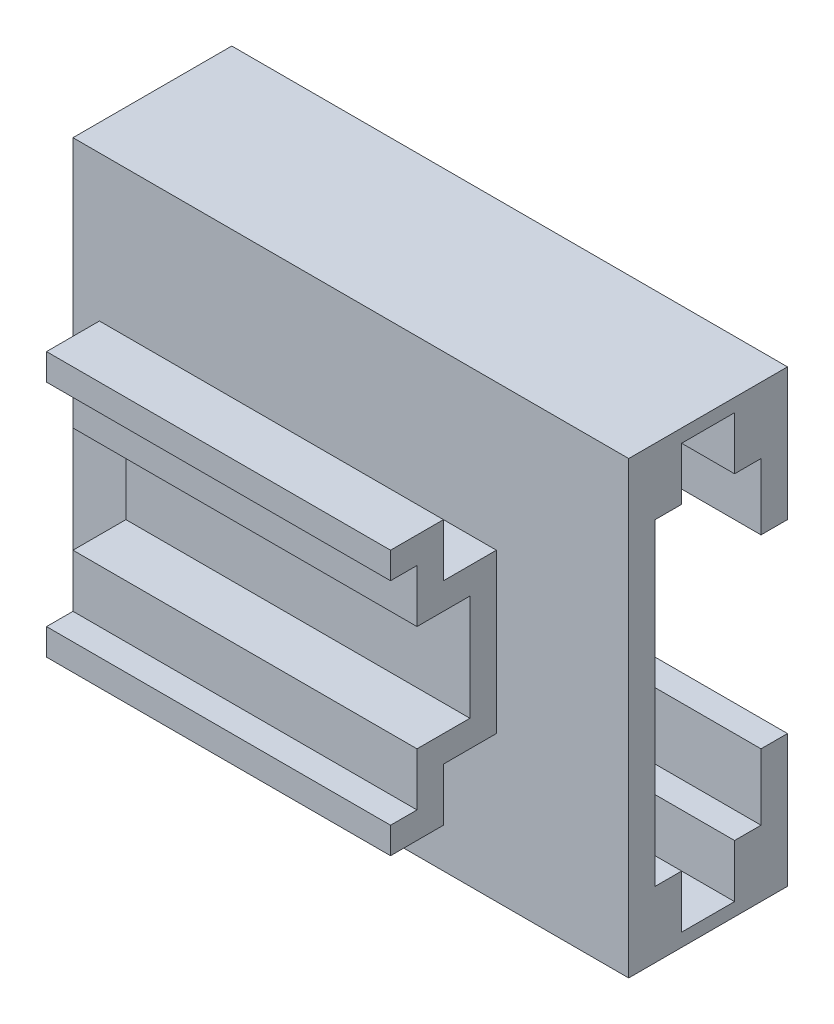
ISO-10303-21;
HEADER;
FILE_DESCRIPTION(('STEP AP214'),'2;1');
FILE_NAME('part.step','',(''),(''),'','','');
FILE_SCHEMA(('AUTOMOTIVE_DESIGN { 1 0 10303 214 1 1 1 1 }'));
ENDSEC;
DATA;
#1=APPLICATION_CONTEXT('core data for automotive mechanical design processes');
#2=APPLICATION_PROTOCOL_DEFINITION('international standard','automotive_design',2000,#1);
#3=PRODUCT_CONTEXT('',#1,'mechanical');
#4=PRODUCT('Part','Part','',(#3));
#5=PRODUCT_RELATED_PRODUCT_CATEGORY('part','',(#4));
#6=PRODUCT_DEFINITION_FORMATION('','',#4);
#7=PRODUCT_DEFINITION_CONTEXT('part definition',#1,'design');
#8=PRODUCT_DEFINITION('design','',#6,#7);
#9=PRODUCT_DEFINITION_SHAPE('','',#8);
#10=(LENGTH_UNIT() NAMED_UNIT(*) SI_UNIT(.MILLI.,.METRE.));
#11=(NAMED_UNIT(*) PLANE_ANGLE_UNIT() SI_UNIT($,.RADIAN.));
#12=(NAMED_UNIT(*) SI_UNIT($,.STERADIAN.) SOLID_ANGLE_UNIT());
#13=UNCERTAINTY_MEASURE_WITH_UNIT(LENGTH_MEASURE(1.E-05),#10,'distance_accuracy_value','');
#14=(GEOMETRIC_REPRESENTATION_CONTEXT(3) GLOBAL_UNCERTAINTY_ASSIGNED_CONTEXT((#13)) GLOBAL_UNIT_ASSIGNED_CONTEXT((#10,
#11,#12)) REPRESENTATION_CONTEXT('',''));
#15=CARTESIAN_POINT('',(0.,0.,0.));
#16=DIRECTION('',(0.,0.,1.));
#17=DIRECTION('',(1.,0.,0.));
#18=AXIS2_PLACEMENT_3D('',#15,#16,#17);
#19=CARTESIAN_POINT('',(0.,0.,1.));
#20=DIRECTION('',(0.,0.,1.));
#21=DIRECTION('',(1.,0.,0.));
#22=AXIS2_PLACEMENT_3D('',#19,#20,#21);
#23=PLANE('',#22);
#24=DIRECTION('',(-1.,0.,0.));
#25=VECTOR('',#24,1.);
#26=CARTESIAN_POINT('',(10.5,8.50000000000001,1.));
#27=LINE('',#26,#25);
#28=CARTESIAN_POINT('',(10.5,8.50000000000001,1.));
#29=VERTEX_POINT('',#28);
#30=CARTESIAN_POINT('',(-10.5,8.5,1.));
#31=VERTEX_POINT('',#30);
#32=EDGE_CURVE('E556',#29,#31,#27,.T.);
#33=ORIENTED_EDGE('',*,*,#32,.T.);
#34=DIRECTION('',(0.,-1.,0.));
#35=VECTOR('',#34,1.);
#36=CARTESIAN_POINT('',(-10.5,8.5,1.));
#37=LINE('',#36,#35);
#38=CARTESIAN_POINT('',(-10.5,-8.5,1.));
#39=VERTEX_POINT('',#38);
#40=EDGE_CURVE('E559',#31,#39,#37,.T.);
#41=ORIENTED_EDGE('',*,*,#40,.T.);
#42=DIRECTION('',(-1.,0.,0.));
#43=VECTOR('',#42,1.);
#44=CARTESIAN_POINT('',(10.5,-8.5,1.));
#45=LINE('',#44,#43);
#46=CARTESIAN_POINT('',(10.5,-8.5,1.));
#47=VERTEX_POINT('',#46);
#48=EDGE_CURVE('E562',#47,#39,#45,.T.);
#49=ORIENTED_EDGE('',*,*,#48,.F.);
#50=DIRECTION('',(0.,-1.,0.));
#51=VECTOR('',#50,1.);
#52=CARTESIAN_POINT('',(10.5,8.50000000000001,1.));
#53=LINE('',#52,#51);
#54=EDGE_CURVE('E565',#29,#47,#53,.T.);
#55=ORIENTED_EDGE('',*,*,#54,.F.);
#56=EDGE_LOOP('',(#33,#41,#49,#55));
#57=FACE_BOUND('',#56,.T.);
#58=DIRECTION('',(-1.,0.,0.));
#59=VECTOR('',#58,1.);
#60=CARTESIAN_POINT('',(5.5,-3.,1.));
#61=LINE('',#60,#59);
#62=CARTESIAN_POINT('',(5.5,-3.,1.));
#63=VERTEX_POINT('',#62);
#64=CARTESIAN_POINT('',(-7.5,-3.,1.));
#65=VERTEX_POINT('',#64);
#66=EDGE_CURVE('E401',#63,#65,#61,.T.);
#67=ORIENTED_EDGE('',*,*,#66,.T.);
#68=DIRECTION('',(0.,1.,0.));
#69=VECTOR('',#68,1.);
#70=CARTESIAN_POINT('',(-7.5,0.,1.));
#71=LINE('',#70,#69);
#72=CARTESIAN_POINT('',(-7.5,3.,1.));
#73=VERTEX_POINT('',#72);
#74=EDGE_CURVE('E389',#65,#73,#71,.T.);
#75=ORIENTED_EDGE('',*,*,#74,.T.);
#76=DIRECTION('',(-1.,0.,0.));
#77=VECTOR('',#76,1.);
#78=CARTESIAN_POINT('',(5.5,3.,1.));
#79=LINE('',#78,#77);
#80=CARTESIAN_POINT('',(5.5,3.,1.));
#81=VERTEX_POINT('',#80);
#82=EDGE_CURVE('E404',#81,#73,#79,.T.);
#83=ORIENTED_EDGE('',*,*,#82,.F.);
#84=DIRECTION('',(0.,1.,0.));
#85=VECTOR('',#84,1.);
#86=CARTESIAN_POINT('',(5.5,0.,1.));
#87=LINE('',#86,#85);
#88=EDGE_CURVE('E353',#63,#81,#87,.T.);
#89=ORIENTED_EDGE('',*,*,#88,.F.);
#90=EDGE_LOOP('',(#67,#75,#83,#89));
#91=FACE_BOUND('',#90,.T.);
#92=ADVANCED_FACE('F66',(#57,#91),#23,.T.);
#93=CARTESIAN_POINT('',(10.5,8.50000000000001,1.));
#94=DIRECTION('',(1.,0.,0.));
#95=DIRECTION('',(0.,1.,0.));
#96=AXIS2_PLACEMENT_3D('',#93,#94,#95);
#97=PLANE('',#96);
#98=DIRECTION('',(0.,0.,1.));
#99=VECTOR('',#98,1.);
#100=CARTESIAN_POINT('',(10.5,-6.,-4.));
#101=LINE('',#100,#99);
#102=CARTESIAN_POINT('',(10.5,-6.,-4.));
#103=VERTEX_POINT('',#102);
#104=CARTESIAN_POINT('',(10.5,-6.,-3.));
#105=VERTEX_POINT('',#104);
#106=EDGE_CURVE('E495',#103,#105,#101,.T.);
#107=ORIENTED_EDGE('',*,*,#106,.T.);
#108=DIRECTION('',(0.,-1.,0.));
#109=VECTOR('',#108,1.);
#110=CARTESIAN_POINT('',(10.5,0.,-3.));
#111=LINE('',#110,#109);
#112=CARTESIAN_POINT('',(10.5,-8.,-3.));
#113=VERTEX_POINT('',#112);
#114=EDGE_CURVE('E437',#105,#113,#111,.T.);
#115=ORIENTED_EDGE('',*,*,#114,.T.);
#116=DIRECTION('',(0.,0.,1.));
#117=VECTOR('',#116,1.);
#118=CARTESIAN_POINT('',(10.5,-8.,-3.));
#119=LINE('',#118,#117);
#120=CARTESIAN_POINT('',(10.5,-8.,-1.));
#121=VERTEX_POINT('',#120);
#122=EDGE_CURVE('E457',#113,#121,#119,.T.);
#123=ORIENTED_EDGE('',*,*,#122,.T.);
#124=DIRECTION('',(0.,-1.,0.));
#125=VECTOR('',#124,1.);
#126=CARTESIAN_POINT('',(10.5,0.,-1.));
#127=LINE('',#126,#125);
#128=CARTESIAN_POINT('',(10.5,-6.,-1.));
#129=VERTEX_POINT('',#128);
#130=EDGE_CURVE('E450',#129,#121,#127,.T.);
#131=ORIENTED_EDGE('',*,*,#130,.F.);
#132=CARTESIAN_POINT('',(10.5,-6.,0.));
#133=VERTEX_POINT('',#132);
#134=EDGE_CURVE('E488',#129,#133,#101,.T.);
#135=ORIENTED_EDGE('',*,*,#134,.T.);
#136=DIRECTION('',(0.,-1.,0.));
#137=VECTOR('',#136,1.);
#138=CARTESIAN_POINT('',(10.5,8.50000000000001,0.));
#139=LINE('',#138,#137);
#140=CARTESIAN_POINT('',(10.5,6.,0.));
#141=VERTEX_POINT('',#140);
#142=EDGE_CURVE('E560',#141,#133,#139,.T.);
#143=ORIENTED_EDGE('',*,*,#142,.F.);
#144=DIRECTION('',(0.,0.,1.));
#145=VECTOR('',#144,1.);
#146=CARTESIAN_POINT('',(10.5,6.,-4.));
#147=LINE('',#146,#145);
#148=CARTESIAN_POINT('',(10.5,6.,-1.));
#149=VERTEX_POINT('',#148);
#150=EDGE_CURVE('E547',#149,#141,#147,.T.);
#151=ORIENTED_EDGE('',*,*,#150,.F.);
#152=DIRECTION('',(0.,-1.,0.));
#153=VECTOR('',#152,1.);
#154=CARTESIAN_POINT('',(10.5,0.,-1.));
#155=LINE('',#154,#153);
#156=CARTESIAN_POINT('',(10.5,8.,-1.));
#157=VERTEX_POINT('',#156);
#158=EDGE_CURVE('E89',#157,#149,#155,.T.);
#159=ORIENTED_EDGE('',*,*,#158,.F.);
#160=DIRECTION('',(0.,0.,1.));
#161=VECTOR('',#160,1.);
#162=CARTESIAN_POINT('',(10.5,8.,-3.));
#163=LINE('',#162,#161);
#164=CARTESIAN_POINT('',(10.5,8.,-3.));
#165=VERTEX_POINT('',#164);
#166=EDGE_CURVE('E447',#165,#157,#163,.T.);
#167=ORIENTED_EDGE('',*,*,#166,.F.);
#168=DIRECTION('',(0.,-1.,0.));
#169=VECTOR('',#168,1.);
#170=CARTESIAN_POINT('',(10.5,0.,-3.));
#171=LINE('',#170,#169);
#172=CARTESIAN_POINT('',(10.5,6.,-3.));
#173=VERTEX_POINT('',#172);
#174=EDGE_CURVE('E469',#165,#173,#171,.T.);
#175=ORIENTED_EDGE('',*,*,#174,.T.);
#176=CARTESIAN_POINT('',(10.5,6.,-4.));
#177=VERTEX_POINT('',#176);
#178=EDGE_CURVE('E553',#177,#173,#147,.T.);
#179=ORIENTED_EDGE('',*,*,#178,.F.);
#180=DIRECTION('',(0.,-1.,0.));
#181=VECTOR('',#180,1.);
#182=CARTESIAN_POINT('',(10.5,8.50000000000001,-4.));
#183=LINE('',#182,#181);
#184=CARTESIAN_POINT('',(10.5,3.5,-4.));
#185=VERTEX_POINT('',#184);
#186=EDGE_CURVE('E529',#177,#185,#183,.T.);
#187=ORIENTED_EDGE('',*,*,#186,.T.);
#188=DIRECTION('',(0.,0.,1.));
#189=VECTOR('',#188,1.);
#190=CARTESIAN_POINT('',(10.5,3.5,-5.));
#191=LINE('',#190,#189);
#192=CARTESIAN_POINT('',(10.5,3.5,-5.));
#193=VERTEX_POINT('',#192);
#194=EDGE_CURVE('E520',#193,#185,#191,.T.);
#195=ORIENTED_EDGE('',*,*,#194,.F.);
#196=DIRECTION('',(0.,-1.,0.));
#197=VECTOR('',#196,1.);
#198=CARTESIAN_POINT('',(10.5,8.50000000000001,-5.));
#199=LINE('',#198,#197);
#200=CARTESIAN_POINT('',(10.5,8.50000000000001,-5.));
#201=VERTEX_POINT('',#200);
#202=EDGE_CURVE('E536',#201,#193,#199,.T.);
#203=ORIENTED_EDGE('',*,*,#202,.F.);
#204=DIRECTION('',(0.,0.,-1.));
#205=VECTOR('',#204,1.);
#206=CARTESIAN_POINT('',(10.5,8.50000000000001,1.));
#207=LINE('',#206,#205);
#208=EDGE_CURVE('E568',#29,#201,#207,.T.);
#209=ORIENTED_EDGE('',*,*,#208,.F.);
#210=ORIENTED_EDGE('',*,*,#54,.T.);
#211=DIRECTION('',(0.,0.,-1.));
#212=VECTOR('',#211,1.);
#213=CARTESIAN_POINT('',(10.5,-8.5,1.));
#214=LINE('',#213,#212);
#215=CARTESIAN_POINT('',(10.5,-8.5,-5.));
#216=VERTEX_POINT('',#215);
#217=EDGE_CURVE('E574',#47,#216,#214,.T.);
#218=ORIENTED_EDGE('',*,*,#217,.T.);
#219=CARTESIAN_POINT('',(10.5,-3.5,-5.));
#220=VERTEX_POINT('',#219);
#221=EDGE_CURVE('E535',#220,#216,#199,.T.);
#222=ORIENTED_EDGE('',*,*,#221,.F.);
#223=DIRECTION('',(0.,0.,1.));
#224=VECTOR('',#223,1.);
#225=CARTESIAN_POINT('',(10.5,-3.5,-5.));
#226=LINE('',#225,#224);
#227=CARTESIAN_POINT('',(10.5,-3.5,-4.));
#228=VERTEX_POINT('',#227);
#229=EDGE_CURVE('E507',#220,#228,#226,.T.);
#230=ORIENTED_EDGE('',*,*,#229,.T.);
#231=EDGE_CURVE('E542',#228,#103,#183,.T.);
#232=ORIENTED_EDGE('',*,*,#231,.T.);
#233=EDGE_LOOP('',(#107,#115,#123,#131,#135,#143,#151,#159,#167,#175,#179,#187,#195,#203,#209,
#210,#218,#222,#230,#232));
#234=FACE_BOUND('',#233,.T.);
#235=ADVANCED_FACE('F597',(#234),#97,.T.);
#236=CARTESIAN_POINT('',(0.,6.,-4.));
#237=DIRECTION('',(0.,-1.,0.));
#238=DIRECTION('',(1.,0.,0.));
#239=AXIS2_PLACEMENT_3D('',#236,#237,#238);
#240=PLANE('',#239);
#241=ORIENTED_EDGE('',*,*,#178,.T.);
#242=DIRECTION('',(1.,0.,0.));
#243=VECTOR('',#242,1.);
#244=CARTESIAN_POINT('',(0.,6.,-3.));
#245=LINE('',#244,#243);
#246=CARTESIAN_POINT('',(-9.,6.,-3.));
#247=VERTEX_POINT('',#246);
#248=EDGE_CURVE('E467',#247,#173,#245,.T.);
#249=ORIENTED_EDGE('',*,*,#248,.F.);
#250=DIRECTION('',(0.,0.,1.));
#251=VECTOR('',#250,1.);
#252=CARTESIAN_POINT('',(-9.,6.,-3.));
#253=LINE('',#252,#251);
#254=CARTESIAN_POINT('',(-9.,6.,-1.));
#255=VERTEX_POINT('',#254);
#256=EDGE_CURVE('E481',#247,#255,#253,.T.);
#257=ORIENTED_EDGE('',*,*,#256,.T.);
#258=DIRECTION('',(1.,0.,0.));
#259=VECTOR('',#258,1.);
#260=CARTESIAN_POINT('',(0.,6.,-1.));
#261=LINE('',#260,#259);
#262=EDGE_CURVE('E477',#255,#149,#261,.T.);
#263=ORIENTED_EDGE('',*,*,#262,.T.);
#264=ORIENTED_EDGE('',*,*,#150,.T.);
#265=DIRECTION('',(1.,0.,0.));
#266=VECTOR('',#265,1.);
#267=CARTESIAN_POINT('',(0.,6.,0.));
#268=LINE('',#267,#266);
#269=CARTESIAN_POINT('',(-10.5,6.,0.));
#270=VERTEX_POINT('',#269);
#271=EDGE_CURVE('E539',#270,#141,#268,.T.);
#272=ORIENTED_EDGE('',*,*,#271,.F.);
#273=DIRECTION('',(0.,0.,1.));
#274=VECTOR('',#273,1.);
#275=CARTESIAN_POINT('',(-10.5,6.,-4.));
#276=LINE('',#275,#274);
#277=CARTESIAN_POINT('',(-10.5,6.,-4.));
#278=VERTEX_POINT('',#277);
#279=EDGE_CURVE('E550',#278,#270,#276,.T.);
#280=ORIENTED_EDGE('',*,*,#279,.F.);
#281=DIRECTION('',(1.,0.,0.));
#282=VECTOR('',#281,1.);
#283=CARTESIAN_POINT('',(0.,6.,-4.));
#284=LINE('',#283,#282);
#285=EDGE_CURVE('E544',#278,#177,#284,.T.);
#286=ORIENTED_EDGE('',*,*,#285,.T.);
#287=EDGE_LOOP('',(#241,#249,#257,#263,#264,#272,#280,#286));
#288=FACE_BOUND('',#287,.T.);
#289=ADVANCED_FACE('F744',(#288),#240,.T.);
#290=CARTESIAN_POINT('',(0.,-6.,-4.));
#291=DIRECTION('',(0.,-1.,0.));
#292=DIRECTION('',(1.,0.,0.));
#293=AXIS2_PLACEMENT_3D('',#290,#291,#292);
#294=PLANE('',#293);
#295=DIRECTION('',(1.,0.,0.));
#296=VECTOR('',#295,1.);
#297=CARTESIAN_POINT('',(0.,-6.,-3.));
#298=LINE('',#297,#296);
#299=CARTESIAN_POINT('',(-9.,-6.,-3.));
#300=VERTEX_POINT('',#299);
#301=EDGE_CURVE('E440',#300,#105,#298,.T.);
#302=ORIENTED_EDGE('',*,*,#301,.T.);
#303=ORIENTED_EDGE('',*,*,#106,.F.);
#304=DIRECTION('',(1.,0.,0.));
#305=VECTOR('',#304,1.);
#306=CARTESIAN_POINT('',(0.,-6.,-4.));
#307=LINE('',#306,#305);
#308=CARTESIAN_POINT('',(-10.5,-6.,-4.));
#309=VERTEX_POINT('',#308);
#310=EDGE_CURVE('E485',#309,#103,#307,.T.);
#311=ORIENTED_EDGE('',*,*,#310,.F.);
#312=DIRECTION('',(0.,0.,1.));
#313=VECTOR('',#312,1.);
#314=CARTESIAN_POINT('',(-10.5,-6.,-4.));
#315=LINE('',#314,#313);
#316=CARTESIAN_POINT('',(-10.5,-6.,0.));
#317=VERTEX_POINT('',#316);
#318=EDGE_CURVE('E491',#309,#317,#315,.T.);
#319=ORIENTED_EDGE('',*,*,#318,.T.);
#320=DIRECTION('',(1.,0.,0.));
#321=VECTOR('',#320,1.);
#322=CARTESIAN_POINT('',(0.,-6.,0.));
#323=LINE('',#322,#321);
#324=EDGE_CURVE('E456',#317,#133,#323,.T.);
#325=ORIENTED_EDGE('',*,*,#324,.T.);
#326=ORIENTED_EDGE('',*,*,#134,.F.);
#327=DIRECTION('',(1.,0.,0.));
#328=VECTOR('',#327,1.);
#329=CARTESIAN_POINT('',(0.,-6.,-1.));
#330=LINE('',#329,#328);
#331=CARTESIAN_POINT('',(-9.,-6.,-1.));
#332=VERTEX_POINT('',#331);
#333=EDGE_CURVE('E434',#332,#129,#330,.T.);
#334=ORIENTED_EDGE('',*,*,#333,.F.);
#335=DIRECTION('',(0.,0.,1.));
#336=VECTOR('',#335,1.);
#337=CARTESIAN_POINT('',(-9.,-6.,-3.));
#338=LINE('',#337,#336);
#339=EDGE_CURVE('E453',#300,#332,#338,.T.);
#340=ORIENTED_EDGE('',*,*,#339,.F.);
#341=EDGE_LOOP('',(#302,#303,#311,#319,#325,#326,#334,#340));
#342=FACE_BOUND('',#341,.T.);
#343=ADVANCED_FACE('F740',(#342),#294,.F.);
#344=CARTESIAN_POINT('',(0.,0.,0.));
#345=DIRECTION('',(0.,0.,1.));
#346=DIRECTION('',(1.,0.,0.));
#347=AXIS2_PLACEMENT_3D('',#344,#345,#346);
#348=PLANE('',#347);
#349=ORIENTED_EDGE('',*,*,#324,.F.);
#350=DIRECTION('',(0.,-1.,0.));
#351=VECTOR('',#350,1.);
#352=CARTESIAN_POINT('',(-10.5,8.5,0.));
#353=LINE('',#352,#351);
#354=EDGE_CURVE('E552',#270,#317,#353,.T.);
#355=ORIENTED_EDGE('',*,*,#354,.F.);
#356=ORIENTED_EDGE('',*,*,#271,.T.);
#357=ORIENTED_EDGE('',*,*,#142,.T.);
#358=EDGE_LOOP('',(#349,#355,#356,#357));
#359=FACE_BOUND('',#358,.T.);
#360=ADVANCED_FACE('F743',(#359),#348,.F.);
#361=CARTESIAN_POINT('',(0.,0.,-4.));
#362=DIRECTION('',(0.,0.,1.));
#363=DIRECTION('',(1.,0.,0.));
#364=AXIS2_PLACEMENT_3D('',#361,#362,#363);
#365=PLANE('',#364);
#366=DIRECTION('',(0.,-1.,0.));
#367=VECTOR('',#366,1.);
#368=CARTESIAN_POINT('',(-10.5,8.5,-4.));
#369=LINE('',#368,#367);
#370=EDGE_CURVE('E517',#278,#309,#369,.T.);
#371=ORIENTED_EDGE('',*,*,#370,.T.);
#372=ORIENTED_EDGE('',*,*,#310,.T.);
#373=ORIENTED_EDGE('',*,*,#231,.F.);
#374=DIRECTION('',(-1.,0.,0.));
#375=VECTOR('',#374,1.);
#376=CARTESIAN_POINT('',(0.,-3.5,-4.));
#377=LINE('',#376,#375);
#378=CARTESIAN_POINT('',(-0.999999999999999,-3.5,-4.));
#379=VERTEX_POINT('',#378);
#380=EDGE_CURVE('E494',#228,#379,#377,.T.);
#381=ORIENTED_EDGE('',*,*,#380,.T.);
#382=DIRECTION('',(0.,-1.,0.));
#383=VECTOR('',#382,1.);
#384=CARTESIAN_POINT('',(-0.999999999999999,0.,-4.));
#385=LINE('',#384,#383);
#386=CARTESIAN_POINT('',(-0.999999999999999,3.5,-4.));
#387=VERTEX_POINT('',#386);
#388=EDGE_CURVE('E501',#387,#379,#385,.T.);
#389=ORIENTED_EDGE('',*,*,#388,.F.);
#390=DIRECTION('',(-1.,0.,0.));
#391=VECTOR('',#390,1.);
#392=CARTESIAN_POINT('',(0.,3.5,-4.));
#393=LINE('',#392,#391);
#394=EDGE_CURVE('E510',#185,#387,#393,.T.);
#395=ORIENTED_EDGE('',*,*,#394,.F.);
#396=ORIENTED_EDGE('',*,*,#186,.F.);
#397=ORIENTED_EDGE('',*,*,#285,.F.);
#398=EDGE_LOOP('',(#371,#372,#373,#381,#389,#395,#396,#397));
#399=FACE_BOUND('',#398,.T.);
#400=ADVANCED_FACE('F604',(#399),#365,.T.);
#401=CARTESIAN_POINT('',(10.5,8.50000000000001,1.));
#402=DIRECTION('',(0.,-1.,0.));
#403=DIRECTION('',(1.,0.,0.));
#404=AXIS2_PLACEMENT_3D('',#401,#402,#403);
#405=PLANE('',#404);
#406=ORIENTED_EDGE('',*,*,#208,.T.);
#407=DIRECTION('',(-1.,0.,0.));
#408=VECTOR('',#407,1.);
#409=CARTESIAN_POINT('',(10.5,8.50000000000001,-5.));
#410=LINE('',#409,#408);
#411=CARTESIAN_POINT('',(-10.5,8.5,-5.));
#412=VERTEX_POINT('',#411);
#413=EDGE_CURVE('E525',#201,#412,#410,.T.);
#414=ORIENTED_EDGE('',*,*,#413,.T.);
#415=DIRECTION('',(0.,0.,-1.));
#416=VECTOR('',#415,1.);
#417=CARTESIAN_POINT('',(-10.5,8.5,1.));
#418=LINE('',#417,#416);
#419=EDGE_CURVE('E12',#31,#412,#418,.T.);
#420=ORIENTED_EDGE('',*,*,#419,.F.);
#421=ORIENTED_EDGE('',*,*,#32,.F.);
#422=EDGE_LOOP('',(#406,#414,#420,#421));
#423=FACE_BOUND('',#422,.T.);
#424=ADVANCED_FACE('F68',(#423),#405,.F.);
#425=CARTESIAN_POINT('',(-10.5,8.5,1.));
#426=DIRECTION('',(1.,0.,0.));
#427=DIRECTION('',(0.,1.,0.));
#428=AXIS2_PLACEMENT_3D('',#425,#426,#427);
#429=PLANE('',#428);
#430=DIRECTION('',(0.,-1.,0.));
#431=VECTOR('',#430,1.);
#432=CARTESIAN_POINT('',(-10.5,8.5,-5.));
#433=LINE('',#432,#431);
#434=CARTESIAN_POINT('',(-10.5,-8.5,-5.));
#435=VERTEX_POINT('',#434);
#436=EDGE_CURVE('E528',#412,#435,#433,.T.);
#437=ORIENTED_EDGE('',*,*,#436,.T.);
#438=DIRECTION('',(0.,0.,-1.));
#439=VECTOR('',#438,1.);
#440=CARTESIAN_POINT('',(-10.5,-8.5,1.));
#441=LINE('',#440,#439);
#442=EDGE_CURVE('E74',#39,#435,#441,.T.);
#443=ORIENTED_EDGE('',*,*,#442,.F.);
#444=ORIENTED_EDGE('',*,*,#40,.F.);
#445=ORIENTED_EDGE('',*,*,#419,.T.);
#446=EDGE_LOOP('',(#437,#443,#444,#445));
#447=FACE_BOUND('',#446,.T.);
#448=ORIENTED_EDGE('',*,*,#354,.T.);
#449=ORIENTED_EDGE('',*,*,#318,.F.);
#450=ORIENTED_EDGE('',*,*,#370,.F.);
#451=ORIENTED_EDGE('',*,*,#279,.T.);
#452=EDGE_LOOP('',(#448,#449,#450,#451));
#453=FACE_BOUND('',#452,.T.);
#454=ADVANCED_FACE('F588',(#447,#453),#429,.F.);
#455=CARTESIAN_POINT('',(10.5,-8.5,1.));
#456=DIRECTION('',(0.,-1.,0.));
#457=DIRECTION('',(1.,0.,0.));
#458=AXIS2_PLACEMENT_3D('',#455,#456,#457);
#459=PLANE('',#458);
#460=ORIENTED_EDGE('',*,*,#442,.T.);
#461=DIRECTION('',(-1.,0.,0.));
#462=VECTOR('',#461,1.);
#463=CARTESIAN_POINT('',(10.5,-8.5,-5.));
#464=LINE('',#463,#462);
#465=EDGE_CURVE('E532',#216,#435,#464,.T.);
#466=ORIENTED_EDGE('',*,*,#465,.F.);
#467=ORIENTED_EDGE('',*,*,#217,.F.);
#468=ORIENTED_EDGE('',*,*,#48,.T.);
#469=EDGE_LOOP('',(#460,#466,#467,#468));
#470=FACE_BOUND('',#469,.T.);
#471=ADVANCED_FACE('F578',(#470),#459,.T.);
#472=CARTESIAN_POINT('',(0.,0.,-5.));
#473=DIRECTION('',(0.,0.,1.));
#474=DIRECTION('',(1.,0.,0.));
#475=AXIS2_PLACEMENT_3D('',#472,#473,#474);
#476=PLANE('',#475);
#477=DIRECTION('',(-1.,0.,0.));
#478=VECTOR('',#477,1.);
#479=CARTESIAN_POINT('',(0.,-3.5,-5.));
#480=LINE('',#479,#478);
#481=CARTESIAN_POINT('',(-0.999999999999999,-3.5,-5.));
#482=VERTEX_POINT('',#481);
#483=EDGE_CURVE('E498',#220,#482,#480,.T.);
#484=ORIENTED_EDGE('',*,*,#483,.F.);
#485=ORIENTED_EDGE('',*,*,#221,.T.);
#486=ORIENTED_EDGE('',*,*,#465,.T.);
#487=ORIENTED_EDGE('',*,*,#436,.F.);
#488=ORIENTED_EDGE('',*,*,#413,.F.);
#489=ORIENTED_EDGE('',*,*,#202,.T.);
#490=DIRECTION('',(-1.,0.,0.));
#491=VECTOR('',#490,1.);
#492=CARTESIAN_POINT('',(0.,3.5,-5.));
#493=LINE('',#492,#491);
#494=CARTESIAN_POINT('',(-0.999999999999999,3.5,-5.));
#495=VERTEX_POINT('',#494);
#496=EDGE_CURVE('E500',#193,#495,#493,.T.);
#497=ORIENTED_EDGE('',*,*,#496,.T.);
#498=DIRECTION('',(0.,-1.,0.));
#499=VECTOR('',#498,1.);
#500=CARTESIAN_POINT('',(-0.999999999999999,0.,-5.));
#501=LINE('',#500,#499);
#502=EDGE_CURVE('E504',#495,#482,#501,.T.);
#503=ORIENTED_EDGE('',*,*,#502,.T.);
#504=EDGE_LOOP('',(#484,#485,#486,#487,#488,#489,#497,#503));
#505=FACE_BOUND('',#504,.T.);
#506=ADVANCED_FACE('F585',(#505),#476,.F.);
#507=CARTESIAN_POINT('',(0.,-3.5,-5.));
#508=DIRECTION('',(0.,1.,0.));
#509=DIRECTION('',(-1.,0.,0.));
#510=AXIS2_PLACEMENT_3D('',#507,#508,#509);
#511=PLANE('',#510);
#512=ORIENTED_EDGE('',*,*,#380,.F.);
#513=ORIENTED_EDGE('',*,*,#229,.F.);
#514=ORIENTED_EDGE('',*,*,#483,.T.);
#515=DIRECTION('',(0.,0.,1.));
#516=VECTOR('',#515,1.);
#517=CARTESIAN_POINT('',(-0.999999999999999,-3.5,-5.));
#518=LINE('',#517,#516);
#519=EDGE_CURVE('E515',#482,#379,#518,.T.);
#520=ORIENTED_EDGE('',*,*,#519,.T.);
#521=EDGE_LOOP('',(#512,#513,#514,#520));
#522=FACE_BOUND('',#521,.T.);
#523=ADVANCED_FACE('F748',(#522),#511,.T.);
#524=CARTESIAN_POINT('',(-0.999999999999999,0.,-5.));
#525=DIRECTION('',(-1.,0.,0.));
#526=DIRECTION('',(0.,0.,1.));
#527=AXIS2_PLACEMENT_3D('',#524,#525,#526);
#528=PLANE('',#527);
#529=ORIENTED_EDGE('',*,*,#388,.T.);
#530=ORIENTED_EDGE('',*,*,#519,.F.);
#531=ORIENTED_EDGE('',*,*,#502,.F.);
#532=DIRECTION('',(0.,0.,1.));
#533=VECTOR('',#532,1.);
#534=CARTESIAN_POINT('',(-0.999999999999999,3.5,-5.));
#535=LINE('',#534,#533);
#536=EDGE_CURVE('E518',#495,#387,#535,.T.);
#537=ORIENTED_EDGE('',*,*,#536,.T.);
#538=EDGE_LOOP('',(#529,#530,#531,#537));
#539=FACE_BOUND('',#538,.T.);
#540=ADVANCED_FACE('F608',(#539),#528,.F.);
#541=CARTESIAN_POINT('',(0.,3.5,-5.));
#542=DIRECTION('',(0.,1.,0.));
#543=DIRECTION('',(-1.,0.,0.));
#544=AXIS2_PLACEMENT_3D('',#541,#542,#543);
#545=PLANE('',#544);
#546=ORIENTED_EDGE('',*,*,#394,.T.);
#547=ORIENTED_EDGE('',*,*,#536,.F.);
#548=ORIENTED_EDGE('',*,*,#496,.F.);
#549=ORIENTED_EDGE('',*,*,#194,.T.);
#550=EDGE_LOOP('',(#546,#547,#548,#549));
#551=FACE_BOUND('',#550,.T.);
#552=ADVANCED_FACE('F601',(#551),#545,.F.);
#553=CARTESIAN_POINT('',(-9.,0.,-3.));
#554=DIRECTION('',(1.,0.,0.));
#555=DIRECTION('',(0.,0.,-1.));
#556=AXIS2_PLACEMENT_3D('',#553,#554,#555);
#557=PLANE('',#556);
#558=DIRECTION('',(0.,1.,0.));
#559=VECTOR('',#558,1.);
#560=CARTESIAN_POINT('',(-9.,0.,-1.));
#561=LINE('',#560,#559);
#562=CARTESIAN_POINT('',(-9.,-8.,-1.));
#563=VERTEX_POINT('',#562);
#564=EDGE_CURVE('E444',#563,#332,#561,.T.);
#565=ORIENTED_EDGE('',*,*,#564,.F.);
#566=DIRECTION('',(0.,0.,1.));
#567=VECTOR('',#566,1.);
#568=CARTESIAN_POINT('',(-9.,-8.,-3.));
#569=LINE('',#568,#567);
#570=CARTESIAN_POINT('',(-9.,-8.,-3.));
#571=VERTEX_POINT('',#570);
#572=EDGE_CURVE('E443',#571,#563,#569,.T.);
#573=ORIENTED_EDGE('',*,*,#572,.F.);
#574=DIRECTION('',(0.,1.,0.));
#575=VECTOR('',#574,1.);
#576=CARTESIAN_POINT('',(-9.,0.,-3.));
#577=LINE('',#576,#575);
#578=EDGE_CURVE('E430',#571,#300,#577,.T.);
#579=ORIENTED_EDGE('',*,*,#578,.T.);
#580=ORIENTED_EDGE('',*,*,#339,.T.);
#581=EDGE_LOOP('',(#565,#573,#579,#580));
#582=FACE_BOUND('',#581,.T.);
#583=ADVANCED_FACE('F722',(#582),#557,.T.);
#584=CARTESIAN_POINT('',(0.,-8.,-3.));
#585=DIRECTION('',(0.,-1.,0.));
#586=DIRECTION('',(1.,0.,0.));
#587=AXIS2_PLACEMENT_3D('',#584,#585,#586);
#588=PLANE('',#587);
#589=DIRECTION('',(1.,0.,0.));
#590=VECTOR('',#589,1.);
#591=CARTESIAN_POINT('',(0.,-8.,-1.));
#592=LINE('',#591,#590);
#593=EDGE_CURVE('E446',#563,#121,#592,.T.);
#594=ORIENTED_EDGE('',*,*,#593,.T.);
#595=ORIENTED_EDGE('',*,*,#122,.F.);
#596=DIRECTION('',(1.,0.,0.));
#597=VECTOR('',#596,1.);
#598=CARTESIAN_POINT('',(0.,-8.,-3.));
#599=LINE('',#598,#597);
#600=EDGE_CURVE('E433',#571,#113,#599,.T.);
#601=ORIENTED_EDGE('',*,*,#600,.F.);
#602=ORIENTED_EDGE('',*,*,#572,.T.);
#603=EDGE_LOOP('',(#594,#595,#601,#602));
#604=FACE_BOUND('',#603,.T.);
#605=ADVANCED_FACE('F714',(#604),#588,.F.);
#606=CARTESIAN_POINT('',(0.,0.,-3.));
#607=DIRECTION('',(0.,0.,1.));
#608=DIRECTION('',(1.,0.,0.));
#609=AXIS2_PLACEMENT_3D('',#606,#607,#608);
#610=PLANE('',#609);
#611=ORIENTED_EDGE('',*,*,#578,.F.);
#612=ORIENTED_EDGE('',*,*,#600,.T.);
#613=ORIENTED_EDGE('',*,*,#114,.F.);
#614=ORIENTED_EDGE('',*,*,#301,.F.);
#615=EDGE_LOOP('',(#611,#612,#613,#614));
#616=FACE_BOUND('',#615,.T.);
#617=ADVANCED_FACE('F710',(#616),#610,.T.);
#618=CARTESIAN_POINT('',(0.,0.,-1.));
#619=DIRECTION('',(0.,0.,1.));
#620=DIRECTION('',(1.,0.,0.));
#621=AXIS2_PLACEMENT_3D('',#618,#619,#620);
#622=PLANE('',#621);
#623=ORIENTED_EDGE('',*,*,#564,.T.);
#624=ORIENTED_EDGE('',*,*,#333,.T.);
#625=ORIENTED_EDGE('',*,*,#130,.T.);
#626=ORIENTED_EDGE('',*,*,#593,.F.);
#627=EDGE_LOOP('',(#623,#624,#625,#626));
#628=FACE_BOUND('',#627,.T.);
#629=ADVANCED_FACE('F713',(#628),#622,.F.);
#630=CARTESIAN_POINT('',(0.,8.,-3.));
#631=DIRECTION('',(0.,-1.,0.));
#632=DIRECTION('',(1.,0.,0.));
#633=AXIS2_PLACEMENT_3D('',#630,#631,#632);
#634=PLANE('',#633);
#635=DIRECTION('',(1.,0.,0.));
#636=VECTOR('',#635,1.);
#637=CARTESIAN_POINT('',(0.,8.,-1.));
#638=LINE('',#637,#636);
#639=CARTESIAN_POINT('',(-9.,8.,-1.));
#640=VERTEX_POINT('',#639);
#641=EDGE_CURVE('E396',#640,#157,#638,.T.);
#642=ORIENTED_EDGE('',*,*,#641,.F.);
#643=DIRECTION('',(0.,0.,1.));
#644=VECTOR('',#643,1.);
#645=CARTESIAN_POINT('',(-9.,8.,-3.));
#646=LINE('',#645,#644);
#647=CARTESIAN_POINT('',(-9.,8.,-3.));
#648=VERTEX_POINT('',#647);
#649=EDGE_CURVE('E472',#648,#640,#646,.T.);
#650=ORIENTED_EDGE('',*,*,#649,.F.);
#651=DIRECTION('',(1.,0.,0.));
#652=VECTOR('',#651,1.);
#653=CARTESIAN_POINT('',(0.,8.,-3.));
#654=LINE('',#653,#652);
#655=EDGE_CURVE('E461',#648,#165,#654,.T.);
#656=ORIENTED_EDGE('',*,*,#655,.T.);
#657=ORIENTED_EDGE('',*,*,#166,.T.);
#658=EDGE_LOOP('',(#642,#650,#656,#657));
#659=FACE_BOUND('',#658,.T.);
#660=ADVANCED_FACE('F718',(#659),#634,.T.);
#661=CARTESIAN_POINT('',(-9.,0.,-3.));
#662=DIRECTION('',(-1.,0.,0.));
#663=DIRECTION('',(0.,0.,1.));
#664=AXIS2_PLACEMENT_3D('',#661,#662,#663);
#665=PLANE('',#664);
#666=DIRECTION('',(0.,-1.,0.));
#667=VECTOR('',#666,1.);
#668=CARTESIAN_POINT('',(-9.,0.,-1.));
#669=LINE('',#668,#667);
#670=EDGE_CURVE('E474',#640,#255,#669,.T.);
#671=ORIENTED_EDGE('',*,*,#670,.T.);
#672=ORIENTED_EDGE('',*,*,#256,.F.);
#673=DIRECTION('',(0.,-1.,0.));
#674=VECTOR('',#673,1.);
#675=CARTESIAN_POINT('',(-9.,0.,-3.));
#676=LINE('',#675,#674);
#677=EDGE_CURVE('E464',#648,#247,#676,.T.);
#678=ORIENTED_EDGE('',*,*,#677,.F.);
#679=ORIENTED_EDGE('',*,*,#649,.T.);
#680=EDGE_LOOP('',(#671,#672,#678,#679));
#681=FACE_BOUND('',#680,.T.);
#682=ADVANCED_FACE('F730',(#681),#665,.F.);
#683=CARTESIAN_POINT('',(0.,0.,-3.));
#684=DIRECTION('',(0.,0.,1.));
#685=DIRECTION('',(1.,0.,0.));
#686=AXIS2_PLACEMENT_3D('',#683,#684,#685);
#687=PLANE('',#686);
#688=ORIENTED_EDGE('',*,*,#655,.F.);
#689=ORIENTED_EDGE('',*,*,#677,.T.);
#690=ORIENTED_EDGE('',*,*,#248,.T.);
#691=ORIENTED_EDGE('',*,*,#174,.F.);
#692=EDGE_LOOP('',(#688,#689,#690,#691));
#693=FACE_BOUND('',#692,.T.);
#694=ADVANCED_FACE('F727',(#693),#687,.T.);
#695=CARTESIAN_POINT('',(0.,0.,-1.));
#696=DIRECTION('',(0.,0.,1.));
#697=DIRECTION('',(1.,0.,0.));
#698=AXIS2_PLACEMENT_3D('',#695,#696,#697);
#699=PLANE('',#698);
#700=ORIENTED_EDGE('',*,*,#641,.T.);
#701=ORIENTED_EDGE('',*,*,#158,.T.);
#702=ORIENTED_EDGE('',*,*,#262,.F.);
#703=ORIENTED_EDGE('',*,*,#670,.F.);
#704=EDGE_LOOP('',(#700,#701,#702,#703));
#705=FACE_BOUND('',#704,.T.);
#706=ADVANCED_FACE('F681',(#705),#699,.F.);
#707=CARTESIAN_POINT('',(5.5,0.,5.));
#708=DIRECTION('',(0.,0.,-1.));
#709=DIRECTION('',(-1.,0.,0.));
#710=AXIS2_PLACEMENT_3D('',#707,#708,#709);
#711=PLANE('',#710);
#712=DIRECTION('',(0.,-1.,0.));
#713=VECTOR('',#712,1.);
#714=CARTESIAN_POINT('',(-7.5,0.,5.));
#715=LINE('',#714,#713);
#716=CARTESIAN_POINT('',(-7.5,-4.,5.));
#717=VERTEX_POINT('',#716);
#718=CARTESIAN_POINT('',(-7.5,-5.,5.));
#719=VERTEX_POINT('',#718);
#720=EDGE_CURVE('E362',#717,#719,#715,.T.);
#721=ORIENTED_EDGE('',*,*,#720,.T.);
#722=DIRECTION('',(-1.,0.,0.));
#723=VECTOR('',#722,1.);
#724=CARTESIAN_POINT('',(5.5,-5.,5.));
#725=LINE('',#724,#723);
#726=CARTESIAN_POINT('',(5.5,-5.,5.));
#727=VERTEX_POINT('',#726);
#728=EDGE_CURVE('E323',#727,#719,#725,.T.);
#729=ORIENTED_EDGE('',*,*,#728,.F.);
#730=DIRECTION('',(0.,-1.,0.));
#731=VECTOR('',#730,1.);
#732=CARTESIAN_POINT('',(5.5,0.,5.));
#733=LINE('',#732,#731);
#734=CARTESIAN_POINT('',(5.5,-4.,5.));
#735=VERTEX_POINT('',#734);
#736=EDGE_CURVE('E303',#735,#727,#733,.T.);
#737=ORIENTED_EDGE('',*,*,#736,.F.);
#738=DIRECTION('',(-1.,0.,0.));
#739=VECTOR('',#738,1.);
#740=CARTESIAN_POINT('',(5.5,-4.,5.));
#741=LINE('',#740,#739);
#742=EDGE_CURVE('E312',#735,#717,#741,.T.);
#743=ORIENTED_EDGE('',*,*,#742,.T.);
#744=EDGE_LOOP('',(#721,#729,#737,#743));
#745=FACE_BOUND('',#744,.T.);
#746=ADVANCED_FACE('F322',(#745),#711,.F.);
#747=CARTESIAN_POINT('',(5.5,-5.,0.));
#748=DIRECTION('',(0.,-1.,0.));
#749=DIRECTION('',(1.,0.,0.));
#750=AXIS2_PLACEMENT_3D('',#747,#748,#749);
#751=PLANE('',#750);
#752=DIRECTION('',(0.,0.,1.));
#753=VECTOR('',#752,1.);
#754=CARTESIAN_POINT('',(-7.5,-5.,0.));
#755=LINE('',#754,#753);
#756=CARTESIAN_POINT('',(-7.5,-5.,3.));
#757=VERTEX_POINT('',#756);
#758=EDGE_CURVE('E325',#757,#719,#755,.T.);
#759=ORIENTED_EDGE('',*,*,#758,.F.);
#760=DIRECTION('',(-1.,0.,0.));
#761=VECTOR('',#760,1.);
#762=CARTESIAN_POINT('',(5.5,-5.,3.));
#763=LINE('',#762,#761);
#764=CARTESIAN_POINT('',(5.5,-5.,3.));
#765=VERTEX_POINT('',#764);
#766=EDGE_CURVE('E397',#765,#757,#763,.T.);
#767=ORIENTED_EDGE('',*,*,#766,.F.);
#768=DIRECTION('',(0.,0.,1.));
#769=VECTOR('',#768,1.);
#770=CARTESIAN_POINT('',(5.5,-5.,0.));
#771=LINE('',#770,#769);
#772=EDGE_CURVE('E320',#765,#727,#771,.T.);
#773=ORIENTED_EDGE('',*,*,#772,.T.);
#774=ORIENTED_EDGE('',*,*,#728,.T.);
#775=EDGE_LOOP('',(#759,#767,#773,#774));
#776=FACE_BOUND('',#775,.T.);
#777=ADVANCED_FACE('F673',(#776),#751,.T.);
#778=CARTESIAN_POINT('',(5.5,0.,3.));
#779=DIRECTION('',(0.,0.,-1.));
#780=DIRECTION('',(-1.,0.,0.));
#781=AXIS2_PLACEMENT_3D('',#778,#779,#780);
#782=PLANE('',#781);
#783=DIRECTION('',(0.,-1.,0.));
#784=VECTOR('',#783,1.);
#785=CARTESIAN_POINT('',(-7.5,0.,3.));
#786=LINE('',#785,#784);
#787=CARTESIAN_POINT('',(-7.5,-3.,3.));
#788=VERTEX_POINT('',#787);
#789=EDGE_CURVE('E328',#788,#757,#786,.T.);
#790=ORIENTED_EDGE('',*,*,#789,.F.);
#791=DIRECTION('',(-1.,0.,0.));
#792=VECTOR('',#791,1.);
#793=CARTESIAN_POINT('',(5.5,-3.,3.));
#794=LINE('',#793,#792);
#795=CARTESIAN_POINT('',(5.5,-3.,3.));
#796=VERTEX_POINT('',#795);
#797=EDGE_CURVE('E399',#796,#788,#794,.T.);
#798=ORIENTED_EDGE('',*,*,#797,.F.);
#799=DIRECTION('',(0.,-1.,0.));
#800=VECTOR('',#799,1.);
#801=CARTESIAN_POINT('',(5.5,0.,3.));
#802=LINE('',#801,#800);
#803=EDGE_CURVE('E358',#796,#765,#802,.T.);
#804=ORIENTED_EDGE('',*,*,#803,.T.);
#805=ORIENTED_EDGE('',*,*,#766,.T.);
#806=EDGE_LOOP('',(#790,#798,#804,#805));
#807=FACE_BOUND('',#806,.T.);
#808=ADVANCED_FACE('F624',(#807),#782,.T.);
#809=CARTESIAN_POINT('',(5.5,-3.,0.));
#810=DIRECTION('',(0.,-1.,0.));
#811=DIRECTION('',(1.,0.,0.));
#812=AXIS2_PLACEMENT_3D('',#809,#810,#811);
#813=PLANE('',#812);
#814=DIRECTION('',(0.,0.,1.));
#815=VECTOR('',#814,1.);
#816=CARTESIAN_POINT('',(-7.5,-3.,0.));
#817=LINE('',#816,#815);
#818=EDGE_CURVE('E81',#65,#788,#817,.T.);
#819=ORIENTED_EDGE('',*,*,#818,.F.);
#820=ORIENTED_EDGE('',*,*,#66,.F.);
#821=DIRECTION('',(0.,0.,1.));
#822=VECTOR('',#821,1.);
#823=CARTESIAN_POINT('',(5.5,-3.,0.));
#824=LINE('',#823,#822);
#825=EDGE_CURVE('E355',#63,#796,#824,.T.);
#826=ORIENTED_EDGE('',*,*,#825,.T.);
#827=ORIENTED_EDGE('',*,*,#797,.T.);
#828=EDGE_LOOP('',(#819,#820,#826,#827));
#829=FACE_BOUND('',#828,.T.);
#830=ADVANCED_FACE('F619',(#829),#813,.T.);
#831=CARTESIAN_POINT('',(5.5,3.,0.));
#832=DIRECTION('',(0.,-1.,0.));
#833=DIRECTION('',(1.,0.,0.));
#834=AXIS2_PLACEMENT_3D('',#831,#832,#833);
#835=PLANE('',#834);
#836=DIRECTION('',(0.,0.,1.));
#837=VECTOR('',#836,1.);
#838=CARTESIAN_POINT('',(-7.5,3.,0.));
#839=LINE('',#838,#837);
#840=CARTESIAN_POINT('',(-7.5,3.,3.));
#841=VERTEX_POINT('',#840);
#842=EDGE_CURVE('E387',#73,#841,#839,.T.);
#843=ORIENTED_EDGE('',*,*,#842,.T.);
#844=DIRECTION('',(-1.,0.,0.));
#845=VECTOR('',#844,1.);
#846=CARTESIAN_POINT('',(5.5,3.,3.));
#847=LINE('',#846,#845);
#848=CARTESIAN_POINT('',(5.5,3.,3.));
#849=VERTEX_POINT('',#848);
#850=EDGE_CURVE('E406',#849,#841,#847,.T.);
#851=ORIENTED_EDGE('',*,*,#850,.F.);
#852=DIRECTION('',(0.,0.,1.));
#853=VECTOR('',#852,1.);
#854=CARTESIAN_POINT('',(5.5,3.,0.));
#855=LINE('',#854,#853);
#856=EDGE_CURVE('E351',#81,#849,#855,.T.);
#857=ORIENTED_EDGE('',*,*,#856,.F.);
#858=ORIENTED_EDGE('',*,*,#82,.T.);
#859=EDGE_LOOP('',(#843,#851,#857,#858));
#860=FACE_BOUND('',#859,.T.);
#861=ADVANCED_FACE('F633',(#860),#835,.F.);
#862=CARTESIAN_POINT('',(5.5,0.,3.));
#863=DIRECTION('',(0.,0.,1.));
#864=DIRECTION('',(1.,0.,0.));
#865=AXIS2_PLACEMENT_3D('',#862,#863,#864);
#866=PLANE('',#865);
#867=DIRECTION('',(0.,1.,0.));
#868=VECTOR('',#867,1.);
#869=CARTESIAN_POINT('',(-7.5,0.,3.));
#870=LINE('',#869,#868);
#871=CARTESIAN_POINT('',(-7.5,5.,3.));
#872=VERTEX_POINT('',#871);
#873=EDGE_CURVE('E385',#841,#872,#870,.T.);
#874=ORIENTED_EDGE('',*,*,#873,.T.);
#875=DIRECTION('',(-1.,0.,0.));
#876=VECTOR('',#875,1.);
#877=CARTESIAN_POINT('',(5.5,5.,3.));
#878=LINE('',#877,#876);
#879=CARTESIAN_POINT('',(5.5,5.,3.));
#880=VERTEX_POINT('',#879);
#881=EDGE_CURVE('E409',#880,#872,#878,.T.);
#882=ORIENTED_EDGE('',*,*,#881,.F.);
#883=DIRECTION('',(0.,1.,0.));
#884=VECTOR('',#883,1.);
#885=CARTESIAN_POINT('',(5.5,0.,3.));
#886=LINE('',#885,#884);
#887=EDGE_CURVE('E349',#849,#880,#886,.T.);
#888=ORIENTED_EDGE('',*,*,#887,.F.);
#889=ORIENTED_EDGE('',*,*,#850,.T.);
#890=EDGE_LOOP('',(#874,#882,#888,#889));
#891=FACE_BOUND('',#890,.T.);
#892=ADVANCED_FACE('F636',(#891),#866,.F.);
#893=CARTESIAN_POINT('',(5.5,5.,0.));
#894=DIRECTION('',(0.,-1.,0.));
#895=DIRECTION('',(1.,0.,0.));
#896=AXIS2_PLACEMENT_3D('',#893,#894,#895);
#897=PLANE('',#896);
#898=DIRECTION('',(0.,0.,1.));
#899=VECTOR('',#898,1.);
#900=CARTESIAN_POINT('',(-7.5,5.,0.));
#901=LINE('',#900,#899);
#902=CARTESIAN_POINT('',(-7.5,5.,5.));
#903=VERTEX_POINT('',#902);
#904=EDGE_CURVE('E383',#872,#903,#901,.T.);
#905=ORIENTED_EDGE('',*,*,#904,.T.);
#906=DIRECTION('',(-1.,0.,0.));
#907=VECTOR('',#906,1.);
#908=CARTESIAN_POINT('',(5.5,5.,5.));
#909=LINE('',#908,#907);
#910=CARTESIAN_POINT('',(5.5,5.,5.));
#911=VERTEX_POINT('',#910);
#912=EDGE_CURVE('E412',#911,#903,#909,.T.);
#913=ORIENTED_EDGE('',*,*,#912,.F.);
#914=DIRECTION('',(0.,0.,1.));
#915=VECTOR('',#914,1.);
#916=CARTESIAN_POINT('',(5.5,5.,0.));
#917=LINE('',#916,#915);
#918=EDGE_CURVE('E347',#880,#911,#917,.T.);
#919=ORIENTED_EDGE('',*,*,#918,.F.);
#920=ORIENTED_EDGE('',*,*,#881,.T.);
#921=EDGE_LOOP('',(#905,#913,#919,#920));
#922=FACE_BOUND('',#921,.T.);
#923=ADVANCED_FACE('F644',(#922),#897,.F.);
#924=CARTESIAN_POINT('',(5.5,0.,5.));
#925=DIRECTION('',(0.,0.,-1.));
#926=DIRECTION('',(-1.,0.,0.));
#927=AXIS2_PLACEMENT_3D('',#924,#925,#926);
#928=PLANE('',#927);
#929=DIRECTION('',(0.,-1.,0.));
#930=VECTOR('',#929,1.);
#931=CARTESIAN_POINT('',(-7.5,0.,5.));
#932=LINE('',#931,#930);
#933=CARTESIAN_POINT('',(-7.5,4.,5.));
#934=VERTEX_POINT('',#933);
#935=EDGE_CURVE('E380',#903,#934,#932,.T.);
#936=ORIENTED_EDGE('',*,*,#935,.T.);
#937=DIRECTION('',(-1.,0.,0.));
#938=VECTOR('',#937,1.);
#939=CARTESIAN_POINT('',(5.5,4.,5.));
#940=LINE('',#939,#938);
#941=CARTESIAN_POINT('',(5.5,4.,5.));
#942=VERTEX_POINT('',#941);
#943=EDGE_CURVE('E415',#942,#934,#940,.T.);
#944=ORIENTED_EDGE('',*,*,#943,.F.);
#945=DIRECTION('',(0.,-1.,0.));
#946=VECTOR('',#945,1.);
#947=CARTESIAN_POINT('',(5.5,0.,5.));
#948=LINE('',#947,#946);
#949=EDGE_CURVE('E345',#911,#942,#948,.T.);
#950=ORIENTED_EDGE('',*,*,#949,.F.);
#951=ORIENTED_EDGE('',*,*,#912,.T.);
#952=EDGE_LOOP('',(#936,#944,#950,#951));
#953=FACE_BOUND('',#952,.T.);
#954=ADVANCED_FACE('F647',(#953),#928,.F.);
#955=CARTESIAN_POINT('',(5.5,4.,0.));
#956=DIRECTION('',(0.,-1.,0.));
#957=DIRECTION('',(1.,0.,0.));
#958=AXIS2_PLACEMENT_3D('',#955,#956,#957);
#959=PLANE('',#958);
#960=DIRECTION('',(0.,0.,1.));
#961=VECTOR('',#960,1.);
#962=CARTESIAN_POINT('',(-7.5,4.,0.));
#963=LINE('',#962,#961);
#964=CARTESIAN_POINT('',(-7.5,4.,4.));
#965=VERTEX_POINT('',#964);
#966=EDGE_CURVE('E377',#965,#934,#963,.T.);
#967=ORIENTED_EDGE('',*,*,#966,.F.);
#968=DIRECTION('',(-1.,0.,0.));
#969=VECTOR('',#968,1.);
#970=CARTESIAN_POINT('',(5.5,4.,4.));
#971=LINE('',#970,#969);
#972=CARTESIAN_POINT('',(5.5,4.,4.));
#973=VERTEX_POINT('',#972);
#974=EDGE_CURVE('E417',#973,#965,#971,.T.);
#975=ORIENTED_EDGE('',*,*,#974,.F.);
#976=DIRECTION('',(0.,0.,1.));
#977=VECTOR('',#976,1.);
#978=CARTESIAN_POINT('',(5.5,4.,0.));
#979=LINE('',#978,#977);
#980=EDGE_CURVE('E342',#973,#942,#979,.T.);
#981=ORIENTED_EDGE('',*,*,#980,.T.);
#982=ORIENTED_EDGE('',*,*,#943,.T.);
#983=EDGE_LOOP('',(#967,#975,#981,#982));
#984=FACE_BOUND('',#983,.T.);
#985=ADVANCED_FACE('F650',(#984),#959,.T.);
#986=CARTESIAN_POINT('',(5.5,0.,4.));
#987=DIRECTION('',(0.,0.,1.));
#988=DIRECTION('',(1.,0.,0.));
#989=AXIS2_PLACEMENT_3D('',#986,#987,#988);
#990=PLANE('',#989);
#991=DIRECTION('',(0.,1.,0.));
#992=VECTOR('',#991,1.);
#993=CARTESIAN_POINT('',(-7.5,0.,4.));
#994=LINE('',#993,#992);
#995=CARTESIAN_POINT('',(-7.5,2.,4.));
#996=VERTEX_POINT('',#995);
#997=EDGE_CURVE('E374',#996,#965,#994,.T.);
#998=ORIENTED_EDGE('',*,*,#997,.F.);
#999=DIRECTION('',(-1.,0.,0.));
#1000=VECTOR('',#999,1.);
#1001=CARTESIAN_POINT('',(5.5,2.,4.));
#1002=LINE('',#1001,#1000);
#1003=CARTESIAN_POINT('',(5.5,2.,4.));
#1004=VERTEX_POINT('',#1003);
#1005=EDGE_CURVE('E419',#1004,#996,#1002,.T.);
#1006=ORIENTED_EDGE('',*,*,#1005,.F.);
#1007=DIRECTION('',(0.,1.,0.));
#1008=VECTOR('',#1007,1.);
#1009=CARTESIAN_POINT('',(5.5,0.,4.));
#1010=LINE('',#1009,#1008);
#1011=EDGE_CURVE('E339',#1004,#973,#1010,.T.);
#1012=ORIENTED_EDGE('',*,*,#1011,.T.);
#1013=ORIENTED_EDGE('',*,*,#974,.T.);
#1014=EDGE_LOOP('',(#998,#1006,#1012,#1013));
#1015=FACE_BOUND('',#1014,.T.);
#1016=ADVANCED_FACE('F655',(#1015),#990,.T.);
#1017=CARTESIAN_POINT('',(5.5,2.,0.));
#1018=DIRECTION('',(0.,-1.,0.));
#1019=DIRECTION('',(1.,0.,0.));
#1020=AXIS2_PLACEMENT_3D('',#1017,#1018,#1019);
#1021=PLANE('',#1020);
#1022=DIRECTION('',(0.,0.,1.));
#1023=VECTOR('',#1022,1.);
#1024=CARTESIAN_POINT('',(-7.5,2.,0.));
#1025=LINE('',#1024,#1023);
#1026=CARTESIAN_POINT('',(-7.5,2.,2.));
#1027=VERTEX_POINT('',#1026);
#1028=EDGE_CURVE('E371',#1027,#996,#1025,.T.);
#1029=ORIENTED_EDGE('',*,*,#1028,.F.);
#1030=DIRECTION('',(-1.,0.,0.));
#1031=VECTOR('',#1030,1.);
#1032=CARTESIAN_POINT('',(5.5,2.,2.));
#1033=LINE('',#1032,#1031);
#1034=CARTESIAN_POINT('',(5.5,2.,2.));
#1035=VERTEX_POINT('',#1034);
#1036=EDGE_CURVE('E421',#1035,#1027,#1033,.T.);
#1037=ORIENTED_EDGE('',*,*,#1036,.F.);
#1038=DIRECTION('',(0.,0.,1.));
#1039=VECTOR('',#1038,1.);
#1040=CARTESIAN_POINT('',(5.5,2.,0.));
#1041=LINE('',#1040,#1039);
#1042=EDGE_CURVE('E336',#1035,#1004,#1041,.T.);
#1043=ORIENTED_EDGE('',*,*,#1042,.T.);
#1044=ORIENTED_EDGE('',*,*,#1005,.T.);
#1045=EDGE_LOOP('',(#1029,#1037,#1043,#1044));
#1046=FACE_BOUND('',#1045,.T.);
#1047=ADVANCED_FACE('F658',(#1046),#1021,.T.);
#1048=CARTESIAN_POINT('',(5.5,0.,2.));
#1049=DIRECTION('',(0.,0.,-1.));
#1050=DIRECTION('',(-1.,0.,0.));
#1051=AXIS2_PLACEMENT_3D('',#1048,#1049,#1050);
#1052=PLANE('',#1051);
#1053=DIRECTION('',(0.,-1.,0.));
#1054=VECTOR('',#1053,1.);
#1055=CARTESIAN_POINT('',(-7.5,0.,2.));
#1056=LINE('',#1055,#1054);
#1057=CARTESIAN_POINT('',(-7.5,-2.,2.));
#1058=VERTEX_POINT('',#1057);
#1059=EDGE_CURVE('E369',#1027,#1058,#1056,.T.);
#1060=ORIENTED_EDGE('',*,*,#1059,.T.);
#1061=DIRECTION('',(-1.,0.,0.));
#1062=VECTOR('',#1061,1.);
#1063=CARTESIAN_POINT('',(5.5,-2.,2.));
#1064=LINE('',#1063,#1062);
#1065=CARTESIAN_POINT('',(5.5,-2.,2.));
#1066=VERTEX_POINT('',#1065);
#1067=EDGE_CURVE('E423',#1066,#1058,#1064,.T.);
#1068=ORIENTED_EDGE('',*,*,#1067,.F.);
#1069=DIRECTION('',(0.,-1.,0.));
#1070=VECTOR('',#1069,1.);
#1071=CARTESIAN_POINT('',(5.5,0.,2.));
#1072=LINE('',#1071,#1070);
#1073=EDGE_CURVE('E334',#1035,#1066,#1072,.T.);
#1074=ORIENTED_EDGE('',*,*,#1073,.F.);
#1075=ORIENTED_EDGE('',*,*,#1036,.T.);
#1076=EDGE_LOOP('',(#1060,#1068,#1074,#1075));
#1077=FACE_BOUND('',#1076,.T.);
#1078=ADVANCED_FACE('F664',(#1077),#1052,.F.);
#1079=CARTESIAN_POINT('',(5.5,-2.,0.));
#1080=DIRECTION('',(0.,-1.,0.));
#1081=DIRECTION('',(1.,0.,0.));
#1082=AXIS2_PLACEMENT_3D('',#1079,#1080,#1081);
#1083=PLANE('',#1082);
#1084=DIRECTION('',(0.,0.,1.));
#1085=VECTOR('',#1084,1.);
#1086=CARTESIAN_POINT('',(-7.5,-2.,0.));
#1087=LINE('',#1086,#1085);
#1088=CARTESIAN_POINT('',(-7.5,-2.,4.));
#1089=VERTEX_POINT('',#1088);
#1090=EDGE_CURVE('E367',#1058,#1089,#1087,.T.);
#1091=ORIENTED_EDGE('',*,*,#1090,.T.);
#1092=DIRECTION('',(-1.,0.,0.));
#1093=VECTOR('',#1092,1.);
#1094=CARTESIAN_POINT('',(5.5,-2.,4.));
#1095=LINE('',#1094,#1093);
#1096=CARTESIAN_POINT('',(5.5,-2.,4.));
#1097=VERTEX_POINT('',#1096);
#1098=EDGE_CURVE('E426',#1097,#1089,#1095,.T.);
#1099=ORIENTED_EDGE('',*,*,#1098,.F.);
#1100=DIRECTION('',(0.,0.,1.));
#1101=VECTOR('',#1100,1.);
#1102=CARTESIAN_POINT('',(5.5,-2.,0.));
#1103=LINE('',#1102,#1101);
#1104=EDGE_CURVE('E332',#1066,#1097,#1103,.T.);
#1105=ORIENTED_EDGE('',*,*,#1104,.F.);
#1106=ORIENTED_EDGE('',*,*,#1067,.T.);
#1107=EDGE_LOOP('',(#1091,#1099,#1105,#1106));
#1108=FACE_BOUND('',#1107,.T.);
#1109=ADVANCED_FACE('F668',(#1108),#1083,.F.);
#1110=CARTESIAN_POINT('',(5.5,0.,4.));
#1111=DIRECTION('',(0.,0.,-1.));
#1112=DIRECTION('',(-1.,0.,0.));
#1113=AXIS2_PLACEMENT_3D('',#1110,#1111,#1112);
#1114=PLANE('',#1113);
#1115=DIRECTION('',(0.,-1.,0.));
#1116=VECTOR('',#1115,1.);
#1117=CARTESIAN_POINT('',(-7.5,0.,4.));
#1118=LINE('',#1117,#1116);
#1119=CARTESIAN_POINT('',(-7.5,-4.,4.));
#1120=VERTEX_POINT('',#1119);
#1121=EDGE_CURVE('E365',#1089,#1120,#1118,.T.);
#1122=ORIENTED_EDGE('',*,*,#1121,.T.);
#1123=DIRECTION('',(-1.,0.,0.));
#1124=VECTOR('',#1123,1.);
#1125=CARTESIAN_POINT('',(5.5,-4.,4.));
#1126=LINE('',#1125,#1124);
#1127=CARTESIAN_POINT('',(5.5,-4.,4.));
#1128=VERTEX_POINT('',#1127);
#1129=EDGE_CURVE('E319',#1128,#1120,#1126,.T.);
#1130=ORIENTED_EDGE('',*,*,#1129,.F.);
#1131=DIRECTION('',(0.,-1.,0.));
#1132=VECTOR('',#1131,1.);
#1133=CARTESIAN_POINT('',(5.5,0.,4.));
#1134=LINE('',#1133,#1132);
#1135=EDGE_CURVE('E306',#1097,#1128,#1134,.T.);
#1136=ORIENTED_EDGE('',*,*,#1135,.F.);
#1137=ORIENTED_EDGE('',*,*,#1098,.T.);
#1138=EDGE_LOOP('',(#1122,#1130,#1136,#1137));
#1139=FACE_BOUND('',#1138,.T.);
#1140=ADVANCED_FACE('F671',(#1139),#1114,.F.);
#1141=CARTESIAN_POINT('',(5.5,-4.,0.));
#1142=DIRECTION('',(0.,-1.,0.));
#1143=DIRECTION('',(1.,0.,0.));
#1144=AXIS2_PLACEMENT_3D('',#1141,#1142,#1143);
#1145=PLANE('',#1144);
#1146=DIRECTION('',(0.,0.,1.));
#1147=VECTOR('',#1146,1.);
#1148=CARTESIAN_POINT('',(-7.5,-4.,0.));
#1149=LINE('',#1148,#1147);
#1150=EDGE_CURVE('E315',#1120,#717,#1149,.T.);
#1151=ORIENTED_EDGE('',*,*,#1150,.T.);
#1152=ORIENTED_EDGE('',*,*,#742,.F.);
#1153=DIRECTION('',(0.,0.,1.));
#1154=VECTOR('',#1153,1.);
#1155=CARTESIAN_POINT('',(5.5,-4.,0.));
#1156=LINE('',#1155,#1154);
#1157=EDGE_CURVE('E298',#1128,#735,#1156,.T.);
#1158=ORIENTED_EDGE('',*,*,#1157,.F.);
#1159=ORIENTED_EDGE('',*,*,#1129,.T.);
#1160=EDGE_LOOP('',(#1151,#1152,#1158,#1159));
#1161=FACE_BOUND('',#1160,.T.);
#1162=ADVANCED_FACE('F313',(#1161),#1145,.F.);
#1163=CARTESIAN_POINT('',(5.5,0.,0.));
#1164=DIRECTION('',(-1.,0.,0.));
#1165=DIRECTION('',(0.,-1.,0.));
#1166=AXIS2_PLACEMENT_3D('',#1163,#1164,#1165);
#1167=PLANE('',#1166);
#1168=ORIENTED_EDGE('',*,*,#736,.T.);
#1169=ORIENTED_EDGE('',*,*,#772,.F.);
#1170=ORIENTED_EDGE('',*,*,#803,.F.);
#1171=ORIENTED_EDGE('',*,*,#825,.F.);
#1172=ORIENTED_EDGE('',*,*,#88,.T.);
#1173=ORIENTED_EDGE('',*,*,#856,.T.);
#1174=ORIENTED_EDGE('',*,*,#887,.T.);
#1175=ORIENTED_EDGE('',*,*,#918,.T.);
#1176=ORIENTED_EDGE('',*,*,#949,.T.);
#1177=ORIENTED_EDGE('',*,*,#980,.F.);
#1178=ORIENTED_EDGE('',*,*,#1011,.F.);
#1179=ORIENTED_EDGE('',*,*,#1042,.F.);
#1180=ORIENTED_EDGE('',*,*,#1073,.T.);
#1181=ORIENTED_EDGE('',*,*,#1104,.T.);
#1182=ORIENTED_EDGE('',*,*,#1135,.T.);
#1183=ORIENTED_EDGE('',*,*,#1157,.T.);
#1184=EDGE_LOOP('',(#1168,#1169,#1170,#1171,#1172,#1173,#1174,#1175,#1176,#1177,#1178,#1179,
#1180,#1181,#1182,#1183));
#1185=FACE_BOUND('',#1184,.T.);
#1186=ADVANCED_FACE('F300',(#1185),#1167,.F.);
#1187=CARTESIAN_POINT('',(-7.5,0.,0.));
#1188=DIRECTION('',(-1.,0.,0.));
#1189=DIRECTION('',(0.,-1.,0.));
#1190=AXIS2_PLACEMENT_3D('',#1187,#1188,#1189);
#1191=PLANE('',#1190);
#1192=ORIENTED_EDGE('',*,*,#720,.F.);
#1193=ORIENTED_EDGE('',*,*,#1150,.F.);
#1194=ORIENTED_EDGE('',*,*,#1121,.F.);
#1195=ORIENTED_EDGE('',*,*,#1090,.F.);
#1196=ORIENTED_EDGE('',*,*,#1059,.F.);
#1197=ORIENTED_EDGE('',*,*,#1028,.T.);
#1198=ORIENTED_EDGE('',*,*,#997,.T.);
#1199=ORIENTED_EDGE('',*,*,#966,.T.);
#1200=ORIENTED_EDGE('',*,*,#935,.F.);
#1201=ORIENTED_EDGE('',*,*,#904,.F.);
#1202=ORIENTED_EDGE('',*,*,#873,.F.);
#1203=ORIENTED_EDGE('',*,*,#842,.F.);
#1204=ORIENTED_EDGE('',*,*,#74,.F.);
#1205=ORIENTED_EDGE('',*,*,#818,.T.);
#1206=ORIENTED_EDGE('',*,*,#789,.T.);
#1207=ORIENTED_EDGE('',*,*,#758,.T.);
#1208=EDGE_LOOP('',(#1192,#1193,#1194,#1195,#1196,#1197,#1198,#1199,#1200,#1201,#1202,#1203,
#1204,#1205,#1206,#1207));
#1209=FACE_BOUND('',#1208,.T.);
#1210=ADVANCED_FACE('F627',(#1209),#1191,.T.);
#1211=CLOSED_SHELL('',(#92,#235,#289,#343,#360,#400,#424,#454,#471,#506,#523,#540,#552,#583,
#605,#617,#629,#660,#682,#694,#706,#746,#777,#808,#830,#861,#892,#923,#954,#985,#1016,#1047,
#1078,#1109,#1140,#1162,#1186,#1210));
#1212=MANIFOLD_SOLID_BREP('B2',#1211);
#1213=ADVANCED_BREP_SHAPE_REPRESENTATION('',(#18,#1212),#14);
#1214=SHAPE_DEFINITION_REPRESENTATION(#9,#1213);
ENDSEC;
END-ISO-10303-21;
